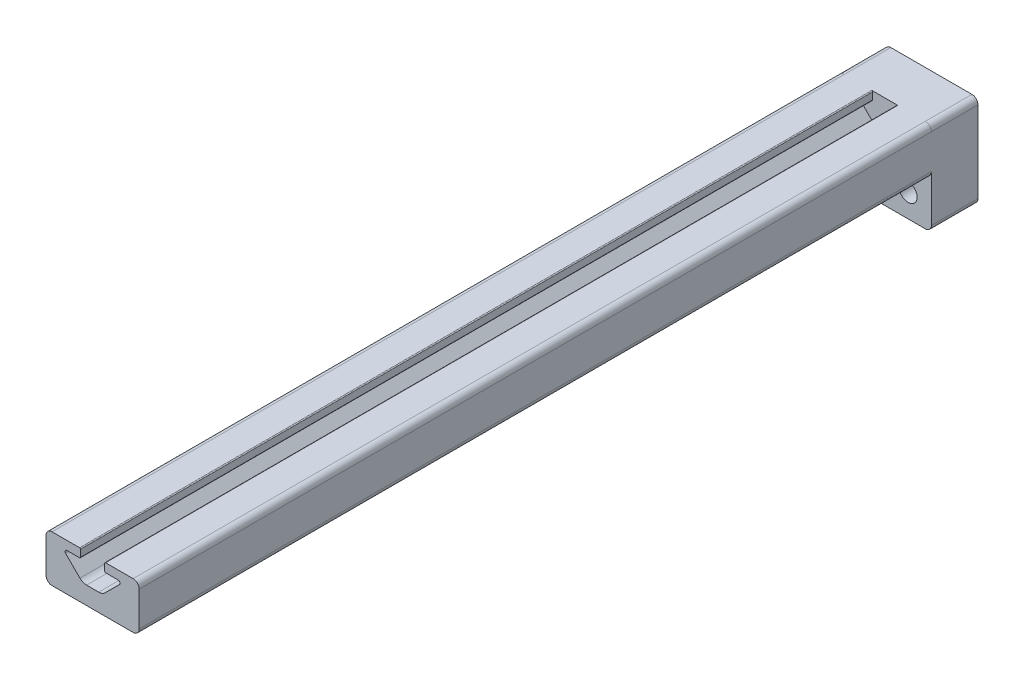
ISO-10303-21;
HEADER;
FILE_DESCRIPTION(('STEP AP214'),'2;1');
FILE_NAME('part.step','',(''),(''),'','','');
FILE_SCHEMA(('AUTOMOTIVE_DESIGN { 1 0 10303 214 1 1 1 1 }'));
ENDSEC;
DATA;
#1=APPLICATION_CONTEXT('core data for automotive mechanical design processes');
#2=APPLICATION_PROTOCOL_DEFINITION('international standard','automotive_design',2000,#1);
#3=PRODUCT_CONTEXT('',#1,'mechanical');
#4=PRODUCT('Part','Part','',(#3));
#5=PRODUCT_RELATED_PRODUCT_CATEGORY('part','',(#4));
#6=PRODUCT_DEFINITION_FORMATION('','',#4);
#7=PRODUCT_DEFINITION_CONTEXT('part definition',#1,'design');
#8=PRODUCT_DEFINITION('design','',#6,#7);
#9=PRODUCT_DEFINITION_SHAPE('','',#8);
#10=(LENGTH_UNIT() NAMED_UNIT(*) SI_UNIT(.MILLI.,.METRE.));
#11=(NAMED_UNIT(*) PLANE_ANGLE_UNIT() SI_UNIT($,.RADIAN.));
#12=(NAMED_UNIT(*) SI_UNIT($,.STERADIAN.) SOLID_ANGLE_UNIT());
#13=UNCERTAINTY_MEASURE_WITH_UNIT(LENGTH_MEASURE(1.E-05),#10,'distance_accuracy_value','');
#14=(GEOMETRIC_REPRESENTATION_CONTEXT(3) GLOBAL_UNCERTAINTY_ASSIGNED_CONTEXT((#13)) GLOBAL_UNIT_ASSIGNED_CONTEXT((#10,
#11,#12)) REPRESENTATION_CONTEXT('',''));
#15=CARTESIAN_POINT('',(0.,0.,0.));
#16=DIRECTION('',(0.,0.,1.));
#17=DIRECTION('',(1.,0.,0.));
#18=AXIS2_PLACEMENT_3D('',#15,#16,#17);
#19=CARTESIAN_POINT('',(-11.049,11.049,215.9));
#20=DIRECTION('',(0.,0.,-1.));
#21=DIRECTION('',(-1.,0.,0.));
#22=AXIS2_PLACEMENT_3D('',#19,#20,#21);
#23=CYLINDRICAL_SURFACE('',#22,1.651);
#24=CARTESIAN_POINT('',(-11.049,11.049,0.));
#25=DIRECTION('',(0.,0.,1.));
#26=DIRECTION('',(1.,0.,0.));
#27=AXIS2_PLACEMENT_3D('',#24,#25,#26);
#28=CIRCLE('',#27,1.651);
#29=CARTESIAN_POINT('',(-11.049,12.7,0.));
#30=VERTEX_POINT('',#29);
#31=CARTESIAN_POINT('',(-12.7,11.049,0.));
#32=VERTEX_POINT('',#31);
#33=EDGE_CURVE('E476',#30,#32,#28,.T.);
#34=ORIENTED_EDGE('',*,*,#33,.T.);
#35=DIRECTION('',(0.,0.,-1.));
#36=VECTOR('',#35,1.);
#37=CARTESIAN_POINT('',(-12.7,11.049,215.9));
#38=LINE('',#37,#36);
#39=CARTESIAN_POINT('',(-12.7,11.049,215.9));
#40=VERTEX_POINT('',#39);
#41=EDGE_CURVE('E288',#40,#32,#38,.T.);
#42=ORIENTED_EDGE('',*,*,#41,.F.);
#43=CARTESIAN_POINT('',(-11.049,11.049,215.9));
#44=DIRECTION('',(0.,0.,1.));
#45=DIRECTION('',(1.,0.,0.));
#46=AXIS2_PLACEMENT_3D('',#43,#44,#45);
#47=CIRCLE('',#46,1.651);
#48=CARTESIAN_POINT('',(-11.049,12.7,215.9));
#49=VERTEX_POINT('',#48);
#50=EDGE_CURVE('E410',#49,#40,#47,.T.);
#51=ORIENTED_EDGE('',*,*,#50,.F.);
#52=DIRECTION('',(0.,0.,-1.));
#53=VECTOR('',#52,1.);
#54=CARTESIAN_POINT('',(-11.049,12.7,215.9));
#55=LINE('',#54,#53);
#56=EDGE_CURVE('E475',#49,#30,#55,.T.);
#57=ORIENTED_EDGE('',*,*,#56,.T.);
#58=EDGE_LOOP('',(#34,#42,#51,#57));
#59=FACE_BOUND('',#58,.T.);
#60=ADVANCED_FACE('F39',(#59),#23,.T.);
#61=CARTESIAN_POINT('',(-12.7,11.049,215.9));
#62=DIRECTION('',(1.,0.,0.));
#63=DIRECTION('',(0.,0.,-1.));
#64=AXIS2_PLACEMENT_3D('',#61,#62,#63);
#65=PLANE('',#64);
#66=DIRECTION('',(0.,1.,0.));
#67=VECTOR('',#66,1.);
#68=CARTESIAN_POINT('',(-12.7,-12.7,-12.7));
#69=LINE('',#68,#67);
#70=CARTESIAN_POINT('',(-12.7,-11.049,-12.7));
#71=VERTEX_POINT('',#70);
#72=CARTESIAN_POINT('',(-12.7,11.049,-12.7));
#73=VERTEX_POINT('',#72);
#74=EDGE_CURVE('E662',#71,#73,#69,.T.);
#75=ORIENTED_EDGE('',*,*,#74,.F.);
#76=DIRECTION('',(0.,0.,1.));
#77=VECTOR('',#76,1.);
#78=CARTESIAN_POINT('',(-12.7,-11.049,215.9));
#79=LINE('',#78,#77);
#80=CARTESIAN_POINT('',(-12.7,-11.049,0.));
#81=VERTEX_POINT('',#80);
#82=EDGE_CURVE('E346',#71,#81,#79,.T.);
#83=ORIENTED_EDGE('',*,*,#82,.T.);
#84=DIRECTION('',(0.,1.,0.));
#85=VECTOR('',#84,1.);
#86=CARTESIAN_POINT('',(-12.7,-12.7,0.));
#87=LINE('',#86,#85);
#88=CARTESIAN_POINT('',(-12.7,1.65099999999999,0.));
#89=VERTEX_POINT('',#88);
#90=EDGE_CURVE('E398',#81,#89,#87,.T.);
#91=ORIENTED_EDGE('',*,*,#90,.T.);
#92=DIRECTION('',(0.,0.,-1.));
#93=VECTOR('',#92,1.);
#94=CARTESIAN_POINT('',(-12.7,1.65099999999999,215.9));
#95=LINE('',#94,#93);
#96=CARTESIAN_POINT('',(-12.7,1.65099999999999,215.9));
#97=VERTEX_POINT('',#96);
#98=EDGE_CURVE('E284',#97,#89,#95,.T.);
#99=ORIENTED_EDGE('',*,*,#98,.F.);
#100=DIRECTION('',(0.,-1.,0.));
#101=VECTOR('',#100,1.);
#102=CARTESIAN_POINT('',(-12.7,11.049,215.9));
#103=LINE('',#102,#101);
#104=EDGE_CURVE('E414',#40,#97,#103,.T.);
#105=ORIENTED_EDGE('',*,*,#104,.F.);
#106=ORIENTED_EDGE('',*,*,#41,.T.);
#107=DIRECTION('',(0.,0.,1.));
#108=VECTOR('',#107,1.);
#109=CARTESIAN_POINT('',(-12.7,11.049,215.9));
#110=LINE('',#109,#108);
#111=EDGE_CURVE('E343',#32,#73,#110,.F.);
#112=ORIENTED_EDGE('',*,*,#111,.T.);
#113=EDGE_LOOP('',(#75,#83,#91,#99,#105,#106,#112));
#114=FACE_BOUND('',#113,.T.);
#115=ADVANCED_FACE('F646',(#114),#65,.F.);
#116=CARTESIAN_POINT('',(-11.049,1.65099999999999,215.9));
#117=DIRECTION('',(0.,0.,-1.));
#118=DIRECTION('',(-1.,0.,0.));
#119=AXIS2_PLACEMENT_3D('',#116,#117,#118);
#120=CYLINDRICAL_SURFACE('',#119,1.651);
#121=CARTESIAN_POINT('',(-11.049,1.65099999999999,0.));
#122=DIRECTION('',(0.,0.,1.));
#123=DIRECTION('',(1.,0.,0.));
#124=AXIS2_PLACEMENT_3D('',#121,#122,#123);
#125=CIRCLE('',#124,1.651);
#126=CARTESIAN_POINT('',(-11.049,0.,0.));
#127=VERTEX_POINT('',#126);
#128=EDGE_CURVE('E480',#89,#127,#125,.T.);
#129=ORIENTED_EDGE('',*,*,#128,.T.);
#130=DIRECTION('',(0.,0.,-1.));
#131=VECTOR('',#130,1.);
#132=CARTESIAN_POINT('',(-11.049,0.,215.9));
#133=LINE('',#132,#131);
#134=CARTESIAN_POINT('',(-11.049,0.,215.9));
#135=VERTEX_POINT('',#134);
#136=EDGE_CURVE('E280',#135,#127,#133,.T.);
#137=ORIENTED_EDGE('',*,*,#136,.F.);
#138=CARTESIAN_POINT('',(-11.049,1.65099999999999,215.9));
#139=DIRECTION('',(0.,0.,1.));
#140=DIRECTION('',(1.,0.,0.));
#141=AXIS2_PLACEMENT_3D('',#138,#139,#140);
#142=CIRCLE('',#141,1.651);
#143=EDGE_CURVE('E418',#97,#135,#142,.T.);
#144=ORIENTED_EDGE('',*,*,#143,.F.);
#145=ORIENTED_EDGE('',*,*,#98,.T.);
#146=EDGE_LOOP('',(#129,#137,#144,#145));
#147=FACE_BOUND('',#146,.T.);
#148=ADVANCED_FACE('F653',(#147),#120,.T.);
#149=CARTESIAN_POINT('',(11.049,0.,215.9));
#150=DIRECTION('',(0.,1.,0.));
#151=DIRECTION('',(-1.,0.,0.));
#152=AXIS2_PLACEMENT_3D('',#149,#150,#151);
#153=PLANE('',#152);
#154=DIRECTION('',(1.,0.,0.));
#155=VECTOR('',#154,1.);
#156=CARTESIAN_POINT('',(11.049,0.,0.));
#157=LINE('',#156,#155);
#158=CARTESIAN_POINT('',(11.049,0.,0.));
#159=VERTEX_POINT('',#158);
#160=EDGE_CURVE('E485',#127,#159,#157,.T.);
#161=ORIENTED_EDGE('',*,*,#160,.T.);
#162=DIRECTION('',(0.,0.,-1.));
#163=VECTOR('',#162,1.);
#164=CARTESIAN_POINT('',(11.049,0.,215.9));
#165=LINE('',#164,#163);
#166=CARTESIAN_POINT('',(11.049,0.,215.9));
#167=VERTEX_POINT('',#166);
#168=EDGE_CURVE('E271',#167,#159,#165,.T.);
#169=ORIENTED_EDGE('',*,*,#168,.F.);
#170=DIRECTION('',(1.,0.,0.));
#171=VECTOR('',#170,1.);
#172=CARTESIAN_POINT('',(11.049,0.,215.9));
#173=LINE('',#172,#171);
#174=EDGE_CURVE('E421',#135,#167,#173,.T.);
#175=ORIENTED_EDGE('',*,*,#174,.F.);
#176=ORIENTED_EDGE('',*,*,#136,.T.);
#177=EDGE_LOOP('',(#161,#169,#175,#176));
#178=FACE_BOUND('',#177,.T.);
#179=ADVANCED_FACE('F656',(#178),#153,.F.);
#180=CARTESIAN_POINT('',(11.049,1.651,215.9));
#181=DIRECTION('',(0.,0.,-1.));
#182=DIRECTION('',(-1.,0.,0.));
#183=AXIS2_PLACEMENT_3D('',#180,#181,#182);
#184=CYLINDRICAL_SURFACE('',#183,1.651);
#185=CARTESIAN_POINT('',(11.049,1.651,0.));
#186=DIRECTION('',(0.,0.,1.));
#187=DIRECTION('',(1.,0.,0.));
#188=AXIS2_PLACEMENT_3D('',#185,#186,#187);
#189=CIRCLE('',#188,1.651);
#190=CARTESIAN_POINT('',(12.7,1.651,0.));
#191=VERTEX_POINT('',#190);
#192=EDGE_CURVE('E246',#159,#191,#189,.T.);
#193=ORIENTED_EDGE('',*,*,#192,.T.);
#194=DIRECTION('',(0.,0.,-1.));
#195=VECTOR('',#194,1.);
#196=CARTESIAN_POINT('',(12.7,1.651,215.9));
#197=LINE('',#196,#195);
#198=CARTESIAN_POINT('',(12.7,1.651,215.9));
#199=VERTEX_POINT('',#198);
#200=EDGE_CURVE('E265',#199,#191,#197,.T.);
#201=ORIENTED_EDGE('',*,*,#200,.F.);
#202=CARTESIAN_POINT('',(11.049,1.651,215.9));
#203=DIRECTION('',(0.,0.,1.));
#204=DIRECTION('',(1.,0.,0.));
#205=AXIS2_PLACEMENT_3D('',#202,#203,#204);
#206=CIRCLE('',#205,1.651);
#207=EDGE_CURVE('E424',#167,#199,#206,.T.);
#208=ORIENTED_EDGE('',*,*,#207,.F.);
#209=ORIENTED_EDGE('',*,*,#168,.T.);
#210=EDGE_LOOP('',(#193,#201,#208,#209));
#211=FACE_BOUND('',#210,.T.);
#212=ADVANCED_FACE('F660',(#211),#184,.T.);
#213=CARTESIAN_POINT('',(12.7,1.651,215.9));
#214=DIRECTION('',(-1.,0.,0.));
#215=DIRECTION('',(0.,0.,1.));
#216=AXIS2_PLACEMENT_3D('',#213,#214,#215);
#217=PLANE('',#216);
#218=DIRECTION('',(0.,-1.,0.));
#219=VECTOR('',#218,1.);
#220=CARTESIAN_POINT('',(12.7,-12.7,0.));
#221=LINE('',#220,#219);
#222=CARTESIAN_POINT('',(12.7,-11.049,0.));
#223=VERTEX_POINT('',#222);
#224=EDGE_CURVE('E376',#191,#223,#221,.T.);
#225=ORIENTED_EDGE('',*,*,#224,.T.);
#226=DIRECTION('',(0.,0.,1.));
#227=VECTOR('',#226,1.);
#228=CARTESIAN_POINT('',(12.7,-11.049,215.9));
#229=LINE('',#228,#227);
#230=CARTESIAN_POINT('',(12.7,-11.049,-12.7));
#231=VERTEX_POINT('',#230);
#232=EDGE_CURVE('E259',#223,#231,#229,.F.);
#233=ORIENTED_EDGE('',*,*,#232,.T.);
#234=DIRECTION('',(0.,-1.,0.));
#235=VECTOR('',#234,1.);
#236=CARTESIAN_POINT('',(12.7,-12.7,-12.7));
#237=LINE('',#236,#235);
#238=CARTESIAN_POINT('',(12.7,11.049,-12.7));
#239=VERTEX_POINT('',#238);
#240=EDGE_CURVE('E257',#239,#231,#237,.T.);
#241=ORIENTED_EDGE('',*,*,#240,.F.);
#242=DIRECTION('',(0.,0.,1.));
#243=VECTOR('',#242,1.);
#244=CARTESIAN_POINT('',(12.7,11.049,215.9));
#245=LINE('',#244,#243);
#246=CARTESIAN_POINT('',(12.7,11.049,0.));
#247=VERTEX_POINT('',#246);
#248=EDGE_CURVE('E240',#239,#247,#245,.T.);
#249=ORIENTED_EDGE('',*,*,#248,.T.);
#250=DIRECTION('',(0.,0.,-1.));
#251=VECTOR('',#250,1.);
#252=CARTESIAN_POINT('',(12.7,11.049,215.9));
#253=LINE('',#252,#251);
#254=CARTESIAN_POINT('',(12.7,11.049,215.9));
#255=VERTEX_POINT('',#254);
#256=EDGE_CURVE('E254',#255,#247,#253,.T.);
#257=ORIENTED_EDGE('',*,*,#256,.F.);
#258=DIRECTION('',(0.,1.,0.));
#259=VECTOR('',#258,1.);
#260=CARTESIAN_POINT('',(12.7,1.651,215.9));
#261=LINE('',#260,#259);
#262=EDGE_CURVE('E427',#199,#255,#261,.T.);
#263=ORIENTED_EDGE('',*,*,#262,.F.);
#264=ORIENTED_EDGE('',*,*,#200,.T.);
#265=EDGE_LOOP('',(#225,#233,#241,#249,#257,#263,#264));
#266=FACE_BOUND('',#265,.T.);
#267=ADVANCED_FACE('F252',(#266),#217,.F.);
#268=CARTESIAN_POINT('',(11.049,11.049,215.9));
#269=DIRECTION('',(0.,0.,-1.));
#270=DIRECTION('',(-1.,0.,0.));
#271=AXIS2_PLACEMENT_3D('',#268,#269,#270);
#272=CYLINDRICAL_SURFACE('',#271,1.651);
#273=CARTESIAN_POINT('',(11.049,11.049,0.));
#274=DIRECTION('',(0.,0.,1.));
#275=DIRECTION('',(1.,0.,0.));
#276=AXIS2_PLACEMENT_3D('',#273,#274,#275);
#277=CIRCLE('',#276,1.651);
#278=CARTESIAN_POINT('',(11.049,12.7,0.));
#279=VERTEX_POINT('',#278);
#280=EDGE_CURVE('E237',#247,#279,#277,.T.);
#281=ORIENTED_EDGE('',*,*,#280,.T.);
#282=DIRECTION('',(0.,0.,-1.));
#283=VECTOR('',#282,1.);
#284=CARTESIAN_POINT('',(11.049,12.7,215.9));
#285=LINE('',#284,#283);
#286=CARTESIAN_POINT('',(11.049,12.7,215.9));
#287=VERTEX_POINT('',#286);
#288=EDGE_CURVE('E266',#287,#279,#285,.T.);
#289=ORIENTED_EDGE('',*,*,#288,.F.);
#290=CARTESIAN_POINT('',(11.049,11.049,215.9));
#291=DIRECTION('',(0.,0.,1.));
#292=DIRECTION('',(1.,0.,0.));
#293=AXIS2_PLACEMENT_3D('',#290,#291,#292);
#294=CIRCLE('',#293,1.651);
#295=EDGE_CURVE('E263',#255,#287,#294,.T.);
#296=ORIENTED_EDGE('',*,*,#295,.F.);
#297=ORIENTED_EDGE('',*,*,#256,.T.);
#298=EDGE_LOOP('',(#281,#289,#296,#297));
#299=FACE_BOUND('',#298,.T.);
#300=ADVANCED_FACE('F262',(#299),#272,.T.);
#301=CARTESIAN_POINT('',(3.302,12.7,215.9));
#302=DIRECTION('',(1.,0.,0.));
#303=DIRECTION('',(0.,1.,0.));
#304=AXIS2_PLACEMENT_3D('',#301,#302,#303);
#305=PLANE('',#304);
#306=DIRECTION('',(0.,-1.,0.));
#307=VECTOR('',#306,1.);
#308=CARTESIAN_POINT('',(3.302,12.7,0.));
#309=LINE('',#308,#307);
#310=CARTESIAN_POINT('',(3.302,12.446,0.));
#311=VERTEX_POINT('',#310);
#312=CARTESIAN_POINT('',(3.302,10.582863886556,0.));
#313=VERTEX_POINT('',#312);
#314=EDGE_CURVE('E245',#311,#313,#309,.T.);
#315=ORIENTED_EDGE('',*,*,#314,.T.);
#316=DIRECTION('',(0.,0.,-1.));
#317=VECTOR('',#316,1.);
#318=CARTESIAN_POINT('',(3.302,10.582863886556,215.9));
#319=LINE('',#318,#317);
#320=CARTESIAN_POINT('',(3.302,10.582863886556,215.9));
#321=VERTEX_POINT('',#320);
#322=EDGE_CURVE('E311',#313,#321,#319,.F.);
#323=ORIENTED_EDGE('',*,*,#322,.T.);
#324=DIRECTION('',(0.,-1.,0.));
#325=VECTOR('',#324,1.);
#326=CARTESIAN_POINT('',(3.302,12.7,215.9));
#327=LINE('',#326,#325);
#328=CARTESIAN_POINT('',(3.302,12.446,215.9));
#329=VERTEX_POINT('',#328);
#330=EDGE_CURVE('E436',#329,#321,#327,.T.);
#331=ORIENTED_EDGE('',*,*,#330,.F.);
#332=DIRECTION('',(0.,0.,-1.));
#333=VECTOR('',#332,1.);
#334=CARTESIAN_POINT('',(3.302,12.446,215.9));
#335=LINE('',#334,#333);
#336=EDGE_CURVE('E307',#329,#311,#335,.T.);
#337=ORIENTED_EDGE('',*,*,#336,.T.);
#338=EDGE_LOOP('',(#315,#323,#331,#337));
#339=FACE_BOUND('',#338,.T.);
#340=ADVANCED_FACE('F584',(#339),#305,.F.);
#341=CARTESIAN_POINT('',(3.302,10.328863886556,215.9));
#342=DIRECTION('',(0.,1.,0.));
#343=DIRECTION('',(0.,0.,1.));
#344=AXIS2_PLACEMENT_3D('',#341,#342,#343);
#345=PLANE('',#344);
#346=DIRECTION('',(1.,0.,0.));
#347=VECTOR('',#346,1.);
#348=CARTESIAN_POINT('',(3.302,10.328863886556,215.9));
#349=LINE('',#348,#347);
#350=CARTESIAN_POINT('',(3.556,10.328863886556,215.9));
#351=VERTEX_POINT('',#350);
#352=CARTESIAN_POINT('',(6.985,10.328863886556,215.9));
#353=VERTEX_POINT('',#352);
#354=EDGE_CURVE('E440',#351,#353,#349,.T.);
#355=ORIENTED_EDGE('',*,*,#354,.F.);
#356=DIRECTION('',(0.,0.,-1.));
#357=VECTOR('',#356,1.);
#358=CARTESIAN_POINT('',(3.556,10.328863886556,215.9));
#359=LINE('',#358,#357);
#360=CARTESIAN_POINT('',(3.556,10.328863886556,0.));
#361=VERTEX_POINT('',#360);
#362=EDGE_CURVE('E291',#351,#361,#359,.T.);
#363=ORIENTED_EDGE('',*,*,#362,.T.);
#364=DIRECTION('',(1.,0.,0.));
#365=VECTOR('',#364,1.);
#366=CARTESIAN_POINT('',(3.302,10.328863886556,0.));
#367=LINE('',#366,#365);
#368=CARTESIAN_POINT('',(6.985,10.328863886556,0.));
#369=VERTEX_POINT('',#368);
#370=EDGE_CURVE('E495',#361,#369,#367,.T.);
#371=ORIENTED_EDGE('',*,*,#370,.T.);
#372=DIRECTION('',(0.,0.,-1.));
#373=VECTOR('',#372,1.);
#374=CARTESIAN_POINT('',(6.985,10.328863886556,215.9));
#375=LINE('',#374,#373);
#376=EDGE_CURVE('E273',#353,#369,#375,.T.);
#377=ORIENTED_EDGE('',*,*,#376,.F.);
#378=EDGE_LOOP('',(#355,#363,#371,#377));
#379=FACE_BOUND('',#378,.T.);
#380=ADVANCED_FACE('F573',(#379),#345,.F.);
#381=CARTESIAN_POINT('',(6.985,9.82086388655604,215.9));
#382=DIRECTION('',(0.,0.,-1.));
#383=DIRECTION('',(-1.,0.,0.));
#384=AXIS2_PLACEMENT_3D('',#381,#382,#383);
#385=CYLINDRICAL_SURFACE('',#384,0.508);
#386=CARTESIAN_POINT('',(6.985,9.82086388655604,0.));
#387=DIRECTION('',(0.,0.,-1.));
#388=DIRECTION('',(1.,0.,0.));
#389=AXIS2_PLACEMENT_3D('',#386,#387,#388);
#390=CIRCLE('',#389,0.508);
#391=CARTESIAN_POINT('',(7.34421024484277,9.46165364171327,0.));
#392=VERTEX_POINT('',#391);
#393=EDGE_CURVE('E499',#369,#392,#390,.T.);
#394=ORIENTED_EDGE('',*,*,#393,.T.);
#395=DIRECTION('',(0.,0.,-1.));
#396=VECTOR('',#395,1.);
#397=CARTESIAN_POINT('',(7.34421024484277,9.46165364171327,215.9));
#398=LINE('',#397,#396);
#399=CARTESIAN_POINT('',(7.34421024484277,9.46165364171327,215.9));
#400=VERTEX_POINT('',#399);
#401=EDGE_CURVE('E561',#400,#392,#398,.T.);
#402=ORIENTED_EDGE('',*,*,#401,.F.);
#403=CARTESIAN_POINT('',(6.985,9.82086388655604,215.9));
#404=DIRECTION('',(0.,0.,-1.));
#405=DIRECTION('',(1.,0.,0.));
#406=AXIS2_PLACEMENT_3D('',#403,#404,#405);
#407=CIRCLE('',#406,0.508);
#408=EDGE_CURVE('E443',#353,#400,#407,.T.);
#409=ORIENTED_EDGE('',*,*,#408,.F.);
#410=ORIENTED_EDGE('',*,*,#376,.T.);
#411=EDGE_LOOP('',(#394,#402,#409,#410));
#412=FACE_BOUND('',#411,.T.);
#413=ADVANCED_FACE('F569',(#412),#385,.F.);
#414=CARTESIAN_POINT('',(7.34421024484277,9.46165364171327,215.9));
#415=DIRECTION('',(0.707106781186549,-0.707106781186546,0.));
#416=DIRECTION('',(0.707106781186546,0.707106781186549,0.));
#417=AXIS2_PLACEMENT_3D('',#414,#415,#416);
#418=PLANE('',#417);
#419=DIRECTION('',(-0.707106781186546,-0.707106781186549,0.));
#420=VECTOR('',#419,1.);
#421=CARTESIAN_POINT('',(7.34421024484277,9.46165364171327,0.));
#422=LINE('',#421,#420);
#423=CARTESIAN_POINT('',(3.45250537891568,5.56994877578617,0.));
#424=VERTEX_POINT('',#423);
#425=EDGE_CURVE('E503',#392,#424,#422,.T.);
#426=ORIENTED_EDGE('',*,*,#425,.T.);
#427=DIRECTION('',(0.,0.,-1.));
#428=VECTOR('',#427,1.);
#429=CARTESIAN_POINT('',(3.45250537891568,5.56994877578617,215.9));
#430=LINE('',#429,#428);
#431=CARTESIAN_POINT('',(3.45250537891568,5.56994877578617,215.9));
#432=VERTEX_POINT('',#431);
#433=EDGE_CURVE('E557',#432,#424,#430,.T.);
#434=ORIENTED_EDGE('',*,*,#433,.F.);
#435=DIRECTION('',(-0.707106781186546,-0.707106781186549,0.));
#436=VECTOR('',#435,1.);
#437=CARTESIAN_POINT('',(7.34421024484277,9.46165364171327,215.9));
#438=LINE('',#437,#436);
#439=EDGE_CURVE('E446',#400,#432,#438,.T.);
#440=ORIENTED_EDGE('',*,*,#439,.F.);
#441=ORIENTED_EDGE('',*,*,#401,.T.);
#442=EDGE_LOOP('',(#426,#434,#440,#441));
#443=FACE_BOUND('',#442,.T.);
#444=ADVANCED_FACE('F637',(#443),#418,.F.);
#445=CARTESIAN_POINT('',(1.65645415470184,7.366,215.9));
#446=DIRECTION('',(0.,0.,-1.));
#447=DIRECTION('',(-1.,0.,0.));
#448=AXIS2_PLACEMENT_3D('',#445,#446,#447);
#449=CYLINDRICAL_SURFACE('',#448,2.54);
#450=CARTESIAN_POINT('',(1.65645415470184,7.366,0.));
#451=DIRECTION('',(0.,0.,-1.));
#452=DIRECTION('',(1.,0.,0.));
#453=AXIS2_PLACEMENT_3D('',#450,#451,#452);
#454=CIRCLE('',#453,2.54);
#455=CARTESIAN_POINT('',(1.65645415470184,4.826,0.));
#456=VERTEX_POINT('',#455);
#457=EDGE_CURVE('E507',#424,#456,#454,.T.);
#458=ORIENTED_EDGE('',*,*,#457,.T.);
#459=DIRECTION('',(0.,0.,-1.));
#460=VECTOR('',#459,1.);
#461=CARTESIAN_POINT('',(1.65645415470184,4.826,215.9));
#462=LINE('',#461,#460);
#463=CARTESIAN_POINT('',(1.65645415470184,4.826,215.9));
#464=VERTEX_POINT('',#463);
#465=EDGE_CURVE('E553',#464,#456,#462,.T.);
#466=ORIENTED_EDGE('',*,*,#465,.F.);
#467=CARTESIAN_POINT('',(1.65645415470184,7.366,215.9));
#468=DIRECTION('',(0.,0.,-1.));
#469=DIRECTION('',(1.,0.,0.));
#470=AXIS2_PLACEMENT_3D('',#467,#468,#469);
#471=CIRCLE('',#470,2.54);
#472=EDGE_CURVE('E449',#432,#464,#471,.T.);
#473=ORIENTED_EDGE('',*,*,#472,.F.);
#474=ORIENTED_EDGE('',*,*,#433,.T.);
#475=EDGE_LOOP('',(#458,#466,#473,#474));
#476=FACE_BOUND('',#475,.T.);
#477=ADVANCED_FACE('F634',(#476),#449,.F.);
#478=CARTESIAN_POINT('',(1.65645415470184,4.826,215.9));
#479=DIRECTION('',(0.,-1.,0.));
#480=DIRECTION('',(1.,0.,0.));
#481=AXIS2_PLACEMENT_3D('',#478,#479,#480);
#482=PLANE('',#481);
#483=DIRECTION('',(-1.,0.,0.));
#484=VECTOR('',#483,1.);
#485=CARTESIAN_POINT('',(1.65645415470184,4.826,0.));
#486=LINE('',#485,#484);
#487=CARTESIAN_POINT('',(-1.65645415470184,4.826,0.));
#488=VERTEX_POINT('',#487);
#489=EDGE_CURVE('E511',#456,#488,#486,.T.);
#490=ORIENTED_EDGE('',*,*,#489,.T.);
#491=DIRECTION('',(0.,0.,-1.));
#492=VECTOR('',#491,1.);
#493=CARTESIAN_POINT('',(-1.65645415470184,4.826,215.9));
#494=LINE('',#493,#492);
#495=CARTESIAN_POINT('',(-1.65645415470184,4.826,215.9));
#496=VERTEX_POINT('',#495);
#497=EDGE_CURVE('E549',#496,#488,#494,.T.);
#498=ORIENTED_EDGE('',*,*,#497,.F.);
#499=DIRECTION('',(-1.,0.,0.));
#500=VECTOR('',#499,1.);
#501=CARTESIAN_POINT('',(1.65645415470184,4.826,215.9));
#502=LINE('',#501,#500);
#503=EDGE_CURVE('E452',#464,#496,#502,.T.);
#504=ORIENTED_EDGE('',*,*,#503,.F.);
#505=ORIENTED_EDGE('',*,*,#465,.T.);
#506=EDGE_LOOP('',(#490,#498,#504,#505));
#507=FACE_BOUND('',#506,.T.);
#508=ADVANCED_FACE('F629',(#507),#482,.F.);
#509=CARTESIAN_POINT('',(-1.65645415470184,7.366,215.9));
#510=DIRECTION('',(0.,0.,-1.));
#511=DIRECTION('',(-1.,0.,0.));
#512=AXIS2_PLACEMENT_3D('',#509,#510,#511);
#513=CYLINDRICAL_SURFACE('',#512,2.54);
#514=CARTESIAN_POINT('',(-1.65645415470184,7.366,0.));
#515=DIRECTION('',(0.,0.,-1.));
#516=DIRECTION('',(1.,0.,0.));
#517=AXIS2_PLACEMENT_3D('',#514,#515,#516);
#518=CIRCLE('',#517,2.54);
#519=CARTESIAN_POINT('',(-3.45250537891568,5.56994877578617,0.));
#520=VERTEX_POINT('',#519);
#521=EDGE_CURVE('E515',#488,#520,#518,.T.);
#522=ORIENTED_EDGE('',*,*,#521,.T.);
#523=DIRECTION('',(0.,0.,-1.));
#524=VECTOR('',#523,1.);
#525=CARTESIAN_POINT('',(-3.45250537891568,5.56994877578617,215.9));
#526=LINE('',#525,#524);
#527=CARTESIAN_POINT('',(-3.45250537891568,5.56994877578617,215.9));
#528=VERTEX_POINT('',#527);
#529=EDGE_CURVE('E545',#528,#520,#526,.T.);
#530=ORIENTED_EDGE('',*,*,#529,.F.);
#531=CARTESIAN_POINT('',(-1.65645415470184,7.366,215.9));
#532=DIRECTION('',(0.,0.,-1.));
#533=DIRECTION('',(1.,0.,0.));
#534=AXIS2_PLACEMENT_3D('',#531,#532,#533);
#535=CIRCLE('',#534,2.54);
#536=EDGE_CURVE('E455',#496,#528,#535,.T.);
#537=ORIENTED_EDGE('',*,*,#536,.F.);
#538=ORIENTED_EDGE('',*,*,#497,.T.);
#539=EDGE_LOOP('',(#522,#530,#537,#538));
#540=FACE_BOUND('',#539,.T.);
#541=ADVANCED_FACE('F626',(#540),#513,.F.);
#542=CARTESIAN_POINT('',(-3.45250537891568,5.56994877578617,215.9));
#543=DIRECTION('',(-0.707106781186549,-0.707106781186546,0.));
#544=DIRECTION('',(0.707106781186546,-0.707106781186549,0.));
#545=AXIS2_PLACEMENT_3D('',#542,#543,#544);
#546=PLANE('',#545);
#547=DIRECTION('',(-0.707106781186546,0.707106781186549,0.));
#548=VECTOR('',#547,1.);
#549=CARTESIAN_POINT('',(-3.45250537891568,5.56994877578617,0.));
#550=LINE('',#549,#548);
#551=CARTESIAN_POINT('',(-7.34421024484277,9.46165364171327,0.));
#552=VERTEX_POINT('',#551);
#553=EDGE_CURVE('E519',#520,#552,#550,.T.);
#554=ORIENTED_EDGE('',*,*,#553,.T.);
#555=DIRECTION('',(0.,0.,-1.));
#556=VECTOR('',#555,1.);
#557=CARTESIAN_POINT('',(-7.34421024484277,9.46165364171327,215.9));
#558=LINE('',#557,#556);
#559=CARTESIAN_POINT('',(-7.34421024484277,9.46165364171327,215.9));
#560=VERTEX_POINT('',#559);
#561=EDGE_CURVE('E541',#560,#552,#558,.T.);
#562=ORIENTED_EDGE('',*,*,#561,.F.);
#563=DIRECTION('',(-0.707106781186546,0.707106781186549,0.));
#564=VECTOR('',#563,1.);
#565=CARTESIAN_POINT('',(-3.45250537891568,5.56994877578617,215.9));
#566=LINE('',#565,#564);
#567=EDGE_CURVE('E458',#528,#560,#566,.T.);
#568=ORIENTED_EDGE('',*,*,#567,.F.);
#569=ORIENTED_EDGE('',*,*,#529,.T.);
#570=EDGE_LOOP('',(#554,#562,#568,#569));
#571=FACE_BOUND('',#570,.T.);
#572=ADVANCED_FACE('F621',(#571),#546,.F.);
#573=CARTESIAN_POINT('',(-6.985,9.82086388655604,215.9));
#574=DIRECTION('',(0.,0.,-1.));
#575=DIRECTION('',(-1.,0.,0.));
#576=AXIS2_PLACEMENT_3D('',#573,#574,#575);
#577=CYLINDRICAL_SURFACE('',#576,0.507999999999999);
#578=CARTESIAN_POINT('',(-6.985,9.82086388655604,0.));
#579=DIRECTION('',(0.,0.,-1.));
#580=DIRECTION('',(1.,0.,0.));
#581=AXIS2_PLACEMENT_3D('',#578,#579,#580);
#582=CIRCLE('',#581,0.507999999999999);
#583=CARTESIAN_POINT('',(-6.985,10.328863886556,0.));
#584=VERTEX_POINT('',#583);
#585=EDGE_CURVE('E523',#552,#584,#582,.T.);
#586=ORIENTED_EDGE('',*,*,#585,.T.);
#587=DIRECTION('',(0.,0.,-1.));
#588=VECTOR('',#587,1.);
#589=CARTESIAN_POINT('',(-6.985,10.328863886556,215.9));
#590=LINE('',#589,#588);
#591=CARTESIAN_POINT('',(-6.985,10.328863886556,215.9));
#592=VERTEX_POINT('',#591);
#593=EDGE_CURVE('E537',#592,#584,#590,.T.);
#594=ORIENTED_EDGE('',*,*,#593,.F.);
#595=CARTESIAN_POINT('',(-6.985,9.82086388655604,215.9));
#596=DIRECTION('',(0.,0.,-1.));
#597=DIRECTION('',(1.,0.,0.));
#598=AXIS2_PLACEMENT_3D('',#595,#596,#597);
#599=CIRCLE('',#598,0.507999999999999);
#600=EDGE_CURVE('E461',#560,#592,#599,.T.);
#601=ORIENTED_EDGE('',*,*,#600,.F.);
#602=ORIENTED_EDGE('',*,*,#561,.T.);
#603=EDGE_LOOP('',(#586,#594,#601,#602));
#604=FACE_BOUND('',#603,.T.);
#605=ADVANCED_FACE('F618',(#604),#577,.F.);
#606=CARTESIAN_POINT('',(-6.985,10.328863886556,215.9));
#607=DIRECTION('',(0.,1.,0.));
#608=DIRECTION('',(-1.,0.,0.));
#609=AXIS2_PLACEMENT_3D('',#606,#607,#608);
#610=PLANE('',#609);
#611=DIRECTION('',(1.,0.,0.));
#612=VECTOR('',#611,1.);
#613=CARTESIAN_POINT('',(-6.985,10.328863886556,0.));
#614=LINE('',#613,#612);
#615=CARTESIAN_POINT('',(-3.556,10.328863886556,0.));
#616=VERTEX_POINT('',#615);
#617=EDGE_CURVE('E527',#584,#616,#614,.T.);
#618=ORIENTED_EDGE('',*,*,#617,.T.);
#619=DIRECTION('',(0.,0.,-1.));
#620=VECTOR('',#619,1.);
#621=CARTESIAN_POINT('',(-3.556,10.328863886556,215.9));
#622=LINE('',#621,#620);
#623=CARTESIAN_POINT('',(-3.556,10.328863886556,215.9));
#624=VERTEX_POINT('',#623);
#625=EDGE_CURVE('E336',#616,#624,#622,.F.);
#626=ORIENTED_EDGE('',*,*,#625,.T.);
#627=DIRECTION('',(1.,0.,0.));
#628=VECTOR('',#627,1.);
#629=CARTESIAN_POINT('',(-6.985,10.328863886556,215.9));
#630=LINE('',#629,#628);
#631=EDGE_CURVE('E464',#592,#624,#630,.T.);
#632=ORIENTED_EDGE('',*,*,#631,.F.);
#633=ORIENTED_EDGE('',*,*,#593,.T.);
#634=EDGE_LOOP('',(#618,#626,#632,#633));
#635=FACE_BOUND('',#634,.T.);
#636=ADVANCED_FACE('F613',(#635),#610,.F.);
#637=CARTESIAN_POINT('',(-3.302,12.7,215.9));
#638=DIRECTION('',(-1.,0.,0.));
#639=DIRECTION('',(0.,-1.,0.));
#640=AXIS2_PLACEMENT_3D('',#637,#638,#639);
#641=PLANE('',#640);
#642=DIRECTION('',(0.,1.,0.));
#643=VECTOR('',#642,1.);
#644=CARTESIAN_POINT('',(-3.302,12.7,215.9));
#645=LINE('',#644,#643);
#646=CARTESIAN_POINT('',(-3.302,10.582863886556,215.9));
#647=VERTEX_POINT('',#646);
#648=CARTESIAN_POINT('',(-3.302,12.446,215.9));
#649=VERTEX_POINT('',#648);
#650=EDGE_CURVE('E468',#647,#649,#645,.T.);
#651=ORIENTED_EDGE('',*,*,#650,.F.);
#652=DIRECTION('',(0.,0.,-1.));
#653=VECTOR('',#652,1.);
#654=CARTESIAN_POINT('',(-3.302,10.582863886556,215.9));
#655=LINE('',#654,#653);
#656=CARTESIAN_POINT('',(-3.302,10.582863886556,0.));
#657=VERTEX_POINT('',#656);
#658=EDGE_CURVE('E332',#647,#657,#655,.T.);
#659=ORIENTED_EDGE('',*,*,#658,.T.);
#660=DIRECTION('',(0.,1.,0.));
#661=VECTOR('',#660,1.);
#662=CARTESIAN_POINT('',(-3.302,12.7,0.));
#663=LINE('',#662,#661);
#664=CARTESIAN_POINT('',(-3.302,12.446,0.));
#665=VERTEX_POINT('',#664);
#666=EDGE_CURVE('E415',#657,#665,#663,.T.);
#667=ORIENTED_EDGE('',*,*,#666,.T.);
#668=DIRECTION('',(0.,0.,-1.));
#669=VECTOR('',#668,1.);
#670=CARTESIAN_POINT('',(-3.302,12.446,215.9));
#671=LINE('',#670,#669);
#672=EDGE_CURVE('E329',#665,#649,#671,.F.);
#673=ORIENTED_EDGE('',*,*,#672,.T.);
#674=EDGE_LOOP('',(#651,#659,#667,#673));
#675=FACE_BOUND('',#674,.T.);
#676=ADVANCED_FACE('F606',(#675),#641,.F.);
#677=CARTESIAN_POINT('',(-11.049,12.7,215.9));
#678=DIRECTION('',(0.,-1.,0.));
#679=DIRECTION('',(1.,0.,0.));
#680=AXIS2_PLACEMENT_3D('',#677,#678,#679);
#681=PLANE('',#680);
#682=DIRECTION('',(1.,0.,0.));
#683=VECTOR('',#682,1.);
#684=CARTESIAN_POINT('',(12.7,12.7,-12.7));
#685=LINE('',#684,#683);
#686=CARTESIAN_POINT('',(-11.049,12.7,-12.7));
#687=VERTEX_POINT('',#686);
#688=CARTESIAN_POINT('',(11.049,12.7,-12.7));
#689=VERTEX_POINT('',#688);
#690=EDGE_CURVE('E481',#687,#689,#685,.T.);
#691=ORIENTED_EDGE('',*,*,#690,.F.);
#692=DIRECTION('',(0.,0.,1.));
#693=VECTOR('',#692,1.);
#694=CARTESIAN_POINT('',(-11.049,12.7,215.9));
#695=LINE('',#694,#693);
#696=EDGE_CURVE('E11',#687,#30,#695,.T.);
#697=ORIENTED_EDGE('',*,*,#696,.T.);
#698=ORIENTED_EDGE('',*,*,#56,.F.);
#699=DIRECTION('',(-1.,0.,0.));
#700=VECTOR('',#699,1.);
#701=CARTESIAN_POINT('',(-11.049,12.7,215.9));
#702=LINE('',#701,#700);
#703=CARTESIAN_POINT('',(-3.556,12.7,215.9));
#704=VERTEX_POINT('',#703);
#705=EDGE_CURVE('E472',#704,#49,#702,.T.);
#706=ORIENTED_EDGE('',*,*,#705,.F.);
#707=DIRECTION('',(0.,0.,-1.));
#708=VECTOR('',#707,1.);
#709=CARTESIAN_POINT('',(-3.556,12.7,215.9));
#710=LINE('',#709,#708);
#711=CARTESIAN_POINT('',(-3.556,12.7,0.));
#712=VERTEX_POINT('',#711);
#713=EDGE_CURVE('E339',#704,#712,#710,.T.);
#714=ORIENTED_EDGE('',*,*,#713,.T.);
#715=DIRECTION('',(1.,0.,0.));
#716=VECTOR('',#715,1.);
#717=CARTESIAN_POINT('',(12.7,12.7,0.));
#718=LINE('',#717,#716);
#719=CARTESIAN_POINT('',(3.556,12.7,0.));
#720=VERTEX_POINT('',#719);
#721=EDGE_CURVE('E384',#712,#720,#718,.T.);
#722=ORIENTED_EDGE('',*,*,#721,.T.);
#723=DIRECTION('',(0.,0.,-1.));
#724=VECTOR('',#723,1.);
#725=CARTESIAN_POINT('',(3.556,12.7,215.9));
#726=LINE('',#725,#724);
#727=CARTESIAN_POINT('',(3.556,12.7,215.9));
#728=VERTEX_POINT('',#727);
#729=EDGE_CURVE('E326',#720,#728,#726,.F.);
#730=ORIENTED_EDGE('',*,*,#729,.T.);
#731=DIRECTION('',(-1.,0.,0.));
#732=VECTOR('',#731,1.);
#733=CARTESIAN_POINT('',(3.302,12.7,215.9));
#734=LINE('',#733,#732);
#735=EDGE_CURVE('E432',#287,#728,#734,.T.);
#736=ORIENTED_EDGE('',*,*,#735,.F.);
#737=ORIENTED_EDGE('',*,*,#288,.T.);
#738=DIRECTION('',(0.,0.,1.));
#739=VECTOR('',#738,1.);
#740=CARTESIAN_POINT('',(11.049,12.7,215.9));
#741=LINE('',#740,#739);
#742=EDGE_CURVE('E48',#279,#689,#741,.F.);
#743=ORIENTED_EDGE('',*,*,#742,.T.);
#744=EDGE_LOOP('',(#691,#697,#698,#706,#714,#722,#730,#736,#737,#743));
#745=FACE_BOUND('',#744,.T.);
#746=ADVANCED_FACE('F595',(#745),#681,.F.);
#747=CARTESIAN_POINT('',(-11.049,11.049,215.9));
#748=DIRECTION('',(0.,0.,1.));
#749=DIRECTION('',(1.,0.,0.));
#750=AXIS2_PLACEMENT_3D('',#747,#748,#749);
#751=PLANE('',#750);
#752=ORIENTED_EDGE('',*,*,#330,.T.);
#753=CARTESIAN_POINT('',(3.556,10.582863886556,215.9));
#754=DIRECTION('',(0.,0.,1.));
#755=DIRECTION('',(1.,0.,0.));
#756=AXIS2_PLACEMENT_3D('',#753,#754,#755);
#757=CIRCLE('',#756,0.254);
#758=EDGE_CURVE('E323',#321,#351,#757,.T.);
#759=ORIENTED_EDGE('',*,*,#758,.T.);
#760=ORIENTED_EDGE('',*,*,#354,.T.);
#761=ORIENTED_EDGE('',*,*,#408,.T.);
#762=ORIENTED_EDGE('',*,*,#439,.T.);
#763=ORIENTED_EDGE('',*,*,#472,.T.);
#764=ORIENTED_EDGE('',*,*,#503,.T.);
#765=ORIENTED_EDGE('',*,*,#536,.T.);
#766=ORIENTED_EDGE('',*,*,#567,.T.);
#767=ORIENTED_EDGE('',*,*,#600,.T.);
#768=ORIENTED_EDGE('',*,*,#631,.T.);
#769=CARTESIAN_POINT('',(-3.556,10.582863886556,215.9));
#770=DIRECTION('',(0.,0.,1.));
#771=DIRECTION('',(1.,0.,0.));
#772=AXIS2_PLACEMENT_3D('',#769,#770,#771);
#773=CIRCLE('',#772,0.254);
#774=EDGE_CURVE('E317',#624,#647,#773,.T.);
#775=ORIENTED_EDGE('',*,*,#774,.T.);
#776=ORIENTED_EDGE('',*,*,#650,.T.);
#777=CARTESIAN_POINT('',(-3.556,12.446,215.9));
#778=DIRECTION('',(0.,0.,1.));
#779=DIRECTION('',(1.,0.,0.));
#780=AXIS2_PLACEMENT_3D('',#777,#778,#779);
#781=CIRCLE('',#780,0.254);
#782=EDGE_CURVE('E314',#649,#704,#781,.T.);
#783=ORIENTED_EDGE('',*,*,#782,.T.);
#784=ORIENTED_EDGE('',*,*,#705,.T.);
#785=ORIENTED_EDGE('',*,*,#50,.T.);
#786=ORIENTED_EDGE('',*,*,#104,.T.);
#787=ORIENTED_EDGE('',*,*,#143,.T.);
#788=ORIENTED_EDGE('',*,*,#174,.T.);
#789=ORIENTED_EDGE('',*,*,#207,.T.);
#790=ORIENTED_EDGE('',*,*,#262,.T.);
#791=ORIENTED_EDGE('',*,*,#295,.T.);
#792=ORIENTED_EDGE('',*,*,#735,.T.);
#793=CARTESIAN_POINT('',(3.556,12.446,215.9));
#794=DIRECTION('',(0.,0.,1.));
#795=DIRECTION('',(1.,0.,0.));
#796=AXIS2_PLACEMENT_3D('',#793,#794,#795);
#797=CIRCLE('',#796,0.254);
#798=EDGE_CURVE('E320',#728,#329,#797,.T.);
#799=ORIENTED_EDGE('',*,*,#798,.T.);
#800=EDGE_LOOP('',(#752,#759,#760,#761,#762,#763,#764,#765,#766,#767,#768,#775,#776,#783,#784,
#785,#786,#787,#788,#789,#790,#791,#792,#799));
#801=FACE_BOUND('',#800,.T.);
#802=ADVANCED_FACE('F587',(#801),#751,.T.);
#803=CARTESIAN_POINT('',(3.556,10.582863886556,215.9));
#804=DIRECTION('',(0.,0.,-1.));
#805=DIRECTION('',(-1.,0.,0.));
#806=AXIS2_PLACEMENT_3D('',#803,#804,#805);
#807=CYLINDRICAL_SURFACE('',#806,0.254);
#808=ORIENTED_EDGE('',*,*,#758,.F.);
#809=ORIENTED_EDGE('',*,*,#322,.F.);
#810=CARTESIAN_POINT('',(3.556,10.582863886556,0.));
#811=DIRECTION('',(0.,0.,1.));
#812=DIRECTION('',(1.,0.,0.));
#813=AXIS2_PLACEMENT_3D('',#810,#811,#812);
#814=CIRCLE('',#813,0.254);
#815=EDGE_CURVE('E304',#361,#313,#814,.F.);
#816=ORIENTED_EDGE('',*,*,#815,.F.);
#817=ORIENTED_EDGE('',*,*,#362,.F.);
#818=EDGE_LOOP('',(#808,#809,#816,#817));
#819=FACE_BOUND('',#818,.T.);
#820=ADVANCED_FACE('F581',(#819),#807,.T.);
#821=CARTESIAN_POINT('',(3.556,12.446,215.9));
#822=DIRECTION('',(0.,0.,-1.));
#823=DIRECTION('',(-1.,0.,0.));
#824=AXIS2_PLACEMENT_3D('',#821,#822,#823);
#825=CYLINDRICAL_SURFACE('',#824,0.254);
#826=ORIENTED_EDGE('',*,*,#798,.F.);
#827=ORIENTED_EDGE('',*,*,#729,.F.);
#828=CARTESIAN_POINT('',(3.556,12.446,0.));
#829=DIRECTION('',(0.,0.,1.));
#830=DIRECTION('',(1.,0.,0.));
#831=AXIS2_PLACEMENT_3D('',#828,#829,#830);
#832=CIRCLE('',#831,0.254);
#833=EDGE_CURVE('E301',#311,#720,#832,.F.);
#834=ORIENTED_EDGE('',*,*,#833,.F.);
#835=ORIENTED_EDGE('',*,*,#336,.F.);
#836=EDGE_LOOP('',(#826,#827,#834,#835));
#837=FACE_BOUND('',#836,.T.);
#838=ADVANCED_FACE('F592',(#837),#825,.T.);
#839=CARTESIAN_POINT('',(-3.556,10.582863886556,215.9));
#840=DIRECTION('',(0.,0.,-1.));
#841=DIRECTION('',(-1.,0.,0.));
#842=AXIS2_PLACEMENT_3D('',#839,#840,#841);
#843=CYLINDRICAL_SURFACE('',#842,0.254);
#844=ORIENTED_EDGE('',*,*,#774,.F.);
#845=ORIENTED_EDGE('',*,*,#625,.F.);
#846=CARTESIAN_POINT('',(-3.556,10.582863886556,0.));
#847=DIRECTION('',(0.,0.,1.));
#848=DIRECTION('',(1.,0.,0.));
#849=AXIS2_PLACEMENT_3D('',#846,#847,#848);
#850=CIRCLE('',#849,0.254);
#851=EDGE_CURVE('E298',#657,#616,#850,.F.);
#852=ORIENTED_EDGE('',*,*,#851,.F.);
#853=ORIENTED_EDGE('',*,*,#658,.F.);
#854=EDGE_LOOP('',(#844,#845,#852,#853));
#855=FACE_BOUND('',#854,.T.);
#856=ADVANCED_FACE('F610',(#855),#843,.T.);
#857=CARTESIAN_POINT('',(-3.556,12.446,215.9));
#858=DIRECTION('',(0.,0.,-1.));
#859=DIRECTION('',(-1.,0.,0.));
#860=AXIS2_PLACEMENT_3D('',#857,#858,#859);
#861=CYLINDRICAL_SURFACE('',#860,0.254);
#862=ORIENTED_EDGE('',*,*,#782,.F.);
#863=ORIENTED_EDGE('',*,*,#672,.F.);
#864=CARTESIAN_POINT('',(-3.556,12.446,0.));
#865=DIRECTION('',(0.,0.,1.));
#866=DIRECTION('',(1.,0.,0.));
#867=AXIS2_PLACEMENT_3D('',#864,#865,#866);
#868=CIRCLE('',#867,0.254);
#869=EDGE_CURVE('E295',#712,#665,#868,.F.);
#870=ORIENTED_EDGE('',*,*,#869,.F.);
#871=ORIENTED_EDGE('',*,*,#713,.F.);
#872=EDGE_LOOP('',(#862,#863,#870,#871));
#873=FACE_BOUND('',#872,.T.);
#874=ADVANCED_FACE('F601',(#873),#861,.T.);
#875=CARTESIAN_POINT('',(0.,0.,0.));
#876=DIRECTION('',(0.,0.,1.));
#877=DIRECTION('',(1.,0.,0.));
#878=AXIS2_PLACEMENT_3D('',#875,#876,#877);
#879=PLANE('',#878);
#880=CARTESIAN_POINT('',(6.35,-6.35,0.));
#881=DIRECTION('',(0.,0.,1.));
#882=DIRECTION('',(1.,0.,0.));
#883=AXIS2_PLACEMENT_3D('',#880,#881,#882);
#884=CIRCLE('',#883,2.45745);
#885=CARTESIAN_POINT('',(8.80744999999999,-6.35,0.));
#886=VERTEX_POINT('',#885);
#887=EDGE_CURVE('E716',#886,#886,#884,.T.);
#888=ORIENTED_EDGE('',*,*,#887,.F.);
#889=EDGE_LOOP('',(#888));
#890=FACE_BOUND('',#889,.T.);
#891=CARTESIAN_POINT('',(-6.35,-6.35,0.));
#892=DIRECTION('',(0.,0.,1.));
#893=DIRECTION('',(1.,0.,0.));
#894=AXIS2_PLACEMENT_3D('',#891,#892,#893);
#895=CIRCLE('',#894,2.45745);
#896=CARTESIAN_POINT('',(-3.89255,-6.35,0.));
#897=VERTEX_POINT('',#896);
#898=EDGE_CURVE('E403',#897,#897,#895,.T.);
#899=ORIENTED_EDGE('',*,*,#898,.F.);
#900=EDGE_LOOP('',(#899));
#901=FACE_BOUND('',#900,.T.);
#902=ORIENTED_EDGE('',*,*,#90,.F.);
#903=CARTESIAN_POINT('',(-11.049,-11.049,0.));
#904=DIRECTION('',(0.,0.,1.));
#905=DIRECTION('',(1.,0.,0.));
#906=AXIS2_PLACEMENT_3D('',#903,#904,#905);
#907=CIRCLE('',#906,1.651);
#908=CARTESIAN_POINT('',(-11.049,-12.7,0.));
#909=VERTEX_POINT('',#908);
#910=EDGE_CURVE('E353',#81,#909,#907,.T.);
#911=ORIENTED_EDGE('',*,*,#910,.T.);
#912=DIRECTION('',(-1.,0.,0.));
#913=VECTOR('',#912,1.);
#914=CARTESIAN_POINT('',(12.7,-12.7,0.));
#915=LINE('',#914,#913);
#916=CARTESIAN_POINT('',(11.049,-12.7,0.));
#917=VERTEX_POINT('',#916);
#918=EDGE_CURVE('E392',#917,#909,#915,.T.);
#919=ORIENTED_EDGE('',*,*,#918,.F.);
#920=CARTESIAN_POINT('',(11.049,-11.049,0.));
#921=DIRECTION('',(0.,0.,1.));
#922=DIRECTION('',(1.,0.,0.));
#923=AXIS2_PLACEMENT_3D('',#920,#921,#922);
#924=CIRCLE('',#923,1.651);
#925=EDGE_CURVE('E350',#917,#223,#924,.T.);
#926=ORIENTED_EDGE('',*,*,#925,.T.);
#927=ORIENTED_EDGE('',*,*,#224,.F.);
#928=ORIENTED_EDGE('',*,*,#192,.F.);
#929=ORIENTED_EDGE('',*,*,#160,.F.);
#930=ORIENTED_EDGE('',*,*,#128,.F.);
#931=EDGE_LOOP('',(#902,#911,#919,#926,#927,#928,#929,#930));
#932=FACE_BOUND('',#931,.T.);
#933=ADVANCED_FACE('F396',(#890,#901,#932),#879,.T.);
#934=CARTESIAN_POINT('',(12.7,-12.7,-12.7));
#935=DIRECTION('',(0.,1.,0.));
#936=DIRECTION('',(0.,0.,1.));
#937=AXIS2_PLACEMENT_3D('',#934,#935,#936);
#938=PLANE('',#937);
#939=ORIENTED_EDGE('',*,*,#918,.T.);
#940=DIRECTION('',(0.,0.,1.));
#941=VECTOR('',#940,1.);
#942=CARTESIAN_POINT('',(-11.049,-12.7,-12.7));
#943=LINE('',#942,#941);
#944=CARTESIAN_POINT('',(-11.049,-12.7,-12.7));
#945=VERTEX_POINT('',#944);
#946=EDGE_CURVE('E360',#909,#945,#943,.F.);
#947=ORIENTED_EDGE('',*,*,#946,.T.);
#948=DIRECTION('',(-1.,0.,0.));
#949=VECTOR('',#948,1.);
#950=CARTESIAN_POINT('',(12.7,-12.7,-12.7));
#951=LINE('',#950,#949);
#952=CARTESIAN_POINT('',(11.049,-12.7,-12.7));
#953=VERTEX_POINT('',#952);
#954=EDGE_CURVE('E383',#953,#945,#951,.T.);
#955=ORIENTED_EDGE('',*,*,#954,.F.);
#956=DIRECTION('',(0.,0.,1.));
#957=VECTOR('',#956,1.);
#958=CARTESIAN_POINT('',(11.049,-12.7,-12.7));
#959=LINE('',#958,#957);
#960=EDGE_CURVE('E356',#953,#917,#959,.T.);
#961=ORIENTED_EDGE('',*,*,#960,.T.);
#962=EDGE_LOOP('',(#939,#947,#955,#961));
#963=FACE_BOUND('',#962,.T.);
#964=ADVANCED_FACE('F391',(#963),#938,.F.);
#965=CARTESIAN_POINT('',(0.,0.,-12.7));
#966=DIRECTION('',(0.,0.,1.));
#967=DIRECTION('',(1.,0.,0.));
#968=AXIS2_PLACEMENT_3D('',#965,#966,#967);
#969=PLANE('',#968);
#970=CARTESIAN_POINT('',(6.35,-6.35,-12.7));
#971=DIRECTION('',(0.,0.,-1.));
#972=DIRECTION('',(-1.,0.,0.));
#973=AXIS2_PLACEMENT_3D('',#970,#971,#972);
#974=CIRCLE('',#973,2.45745);
#975=CARTESIAN_POINT('',(3.89255,-6.35,-12.7));
#976=VERTEX_POINT('',#975);
#977=EDGE_CURVE('E728',#976,#976,#974,.T.);
#978=ORIENTED_EDGE('',*,*,#977,.F.);
#979=EDGE_LOOP('',(#978));
#980=FACE_BOUND('',#979,.T.);
#981=CARTESIAN_POINT('',(-6.35,-6.35,-12.7));
#982=DIRECTION('',(0.,0.,-1.));
#983=DIRECTION('',(-1.,0.,0.));
#984=AXIS2_PLACEMENT_3D('',#981,#982,#983);
#985=CIRCLE('',#984,2.45745);
#986=CARTESIAN_POINT('',(-8.80745,-6.35,-12.7));
#987=VERTEX_POINT('',#986);
#988=EDGE_CURVE('E721',#987,#987,#985,.T.);
#989=ORIENTED_EDGE('',*,*,#988,.F.);
#990=EDGE_LOOP('',(#989));
#991=FACE_BOUND('',#990,.T.);
#992=ORIENTED_EDGE('',*,*,#954,.T.);
#993=CARTESIAN_POINT('',(-11.049,-11.049,-12.7));
#994=DIRECTION('',(0.,0.,1.));
#995=DIRECTION('',(1.,0.,0.));
#996=AXIS2_PLACEMENT_3D('',#993,#994,#995);
#997=CIRCLE('',#996,1.651);
#998=EDGE_CURVE('E260',#945,#71,#997,.F.);
#999=ORIENTED_EDGE('',*,*,#998,.T.);
#1000=ORIENTED_EDGE('',*,*,#74,.T.);
#1001=CARTESIAN_POINT('',(-11.049,11.049,-12.7));
#1002=DIRECTION('',(0.,0.,1.));
#1003=DIRECTION('',(1.,0.,0.));
#1004=AXIS2_PLACEMENT_3D('',#1001,#1002,#1003);
#1005=CIRCLE('',#1004,1.651);
#1006=EDGE_CURVE('E61',#73,#687,#1005,.F.);
#1007=ORIENTED_EDGE('',*,*,#1006,.T.);
#1008=ORIENTED_EDGE('',*,*,#690,.T.);
#1009=CARTESIAN_POINT('',(11.049,11.049,-12.7));
#1010=DIRECTION('',(0.,0.,1.));
#1011=DIRECTION('',(1.,0.,0.));
#1012=AXIS2_PLACEMENT_3D('',#1009,#1010,#1011);
#1013=CIRCLE('',#1012,1.651);
#1014=EDGE_CURVE('E363',#689,#239,#1013,.F.);
#1015=ORIENTED_EDGE('',*,*,#1014,.T.);
#1016=ORIENTED_EDGE('',*,*,#240,.T.);
#1017=CARTESIAN_POINT('',(11.049,-11.049,-12.7));
#1018=DIRECTION('',(0.,0.,1.));
#1019=DIRECTION('',(1.,0.,0.));
#1020=AXIS2_PLACEMENT_3D('',#1017,#1018,#1019);
#1021=CIRCLE('',#1020,1.651);
#1022=EDGE_CURVE('E368',#231,#953,#1021,.F.);
#1023=ORIENTED_EDGE('',*,*,#1022,.T.);
#1024=EDGE_LOOP('',(#992,#999,#1000,#1007,#1008,#1015,#1016,#1023));
#1025=FACE_BOUND('',#1024,.T.);
#1026=ADVANCED_FACE('F380',(#980,#991,#1025),#969,.F.);
#1027=ORIENTED_EDGE('',*,*,#314,.F.);
#1028=ORIENTED_EDGE('',*,*,#833,.T.);
#1029=ORIENTED_EDGE('',*,*,#721,.F.);
#1030=ORIENTED_EDGE('',*,*,#869,.T.);
#1031=ORIENTED_EDGE('',*,*,#666,.F.);
#1032=ORIENTED_EDGE('',*,*,#851,.T.);
#1033=ORIENTED_EDGE('',*,*,#617,.F.);
#1034=ORIENTED_EDGE('',*,*,#585,.F.);
#1035=ORIENTED_EDGE('',*,*,#553,.F.);
#1036=ORIENTED_EDGE('',*,*,#521,.F.);
#1037=ORIENTED_EDGE('',*,*,#489,.F.);
#1038=ORIENTED_EDGE('',*,*,#457,.F.);
#1039=ORIENTED_EDGE('',*,*,#425,.F.);
#1040=ORIENTED_EDGE('',*,*,#393,.F.);
#1041=ORIENTED_EDGE('',*,*,#370,.F.);
#1042=ORIENTED_EDGE('',*,*,#815,.T.);
#1043=EDGE_LOOP('',(#1027,#1028,#1029,#1030,#1031,#1032,#1033,#1034,#1035,#1036,#1037,#1038,
#1039,#1040,#1041,#1042));
#1044=FACE_BOUND('',#1043,.T.);
#1045=ADVANCED_FACE('F577',(#1044),#879,.T.);
#1046=CARTESIAN_POINT('',(-11.049,-11.049,215.9));
#1047=DIRECTION('',(0.,0.,1.));
#1048=DIRECTION('',(1.,0.,0.));
#1049=AXIS2_PLACEMENT_3D('',#1046,#1047,#1048);
#1050=CYLINDRICAL_SURFACE('',#1049,1.651);
#1051=ORIENTED_EDGE('',*,*,#998,.F.);
#1052=ORIENTED_EDGE('',*,*,#946,.F.);
#1053=ORIENTED_EDGE('',*,*,#910,.F.);
#1054=ORIENTED_EDGE('',*,*,#82,.F.);
#1055=EDGE_LOOP('',(#1051,#1052,#1053,#1054));
#1056=FACE_BOUND('',#1055,.T.);
#1057=ADVANCED_FACE('F665',(#1056),#1050,.T.);
#1058=CARTESIAN_POINT('',(11.049,-11.049,-12.7));
#1059=DIRECTION('',(0.,0.,1.));
#1060=DIRECTION('',(1.,0.,0.));
#1061=AXIS2_PLACEMENT_3D('',#1058,#1059,#1060);
#1062=CYLINDRICAL_SURFACE('',#1061,1.651);
#1063=ORIENTED_EDGE('',*,*,#1022,.F.);
#1064=ORIENTED_EDGE('',*,*,#232,.F.);
#1065=ORIENTED_EDGE('',*,*,#925,.F.);
#1066=ORIENTED_EDGE('',*,*,#960,.F.);
#1067=EDGE_LOOP('',(#1063,#1064,#1065,#1066));
#1068=FACE_BOUND('',#1067,.T.);
#1069=ADVANCED_FACE('F387',(#1068),#1062,.T.);
#1070=CARTESIAN_POINT('',(-11.049,11.049,215.9));
#1071=DIRECTION('',(0.,0.,1.));
#1072=DIRECTION('',(1.,0.,0.));
#1073=AXIS2_PLACEMENT_3D('',#1070,#1071,#1072);
#1074=CYLINDRICAL_SURFACE('',#1073,1.651);
#1075=ORIENTED_EDGE('',*,*,#1006,.F.);
#1076=ORIENTED_EDGE('',*,*,#111,.F.);
#1077=ORIENTED_EDGE('',*,*,#33,.F.);
#1078=ORIENTED_EDGE('',*,*,#696,.F.);
#1079=EDGE_LOOP('',(#1075,#1076,#1077,#1078));
#1080=FACE_BOUND('',#1079,.T.);
#1081=ADVANCED_FACE('F673',(#1080),#1074,.T.);
#1082=CARTESIAN_POINT('',(11.049,11.049,215.9));
#1083=DIRECTION('',(0.,0.,1.));
#1084=DIRECTION('',(1.,0.,0.));
#1085=AXIS2_PLACEMENT_3D('',#1082,#1083,#1084);
#1086=CYLINDRICAL_SURFACE('',#1085,1.651);
#1087=ORIENTED_EDGE('',*,*,#1014,.F.);
#1088=ORIENTED_EDGE('',*,*,#742,.F.);
#1089=ORIENTED_EDGE('',*,*,#280,.F.);
#1090=ORIENTED_EDGE('',*,*,#248,.F.);
#1091=EDGE_LOOP('',(#1087,#1088,#1089,#1090));
#1092=FACE_BOUND('',#1091,.T.);
#1093=ADVANCED_FACE('F41',(#1092),#1086,.T.);
#1094=CARTESIAN_POINT('',(-6.35,-6.35,-12.7));
#1095=DIRECTION('',(0.,0.,-1.));
#1096=DIRECTION('',(-1.,0.,0.));
#1097=AXIS2_PLACEMENT_3D('',#1094,#1095,#1096);
#1098=CYLINDRICAL_SURFACE('',#1097,2.45745);
#1099=ORIENTED_EDGE('',*,*,#898,.T.);
#1100=EDGE_LOOP('',(#1099));
#1101=FACE_BOUND('',#1100,.T.);
#1102=ORIENTED_EDGE('',*,*,#988,.T.);
#1103=EDGE_LOOP('',(#1102));
#1104=FACE_BOUND('',#1103,.T.);
#1105=ADVANCED_FACE('F679',(#1101,#1104),#1098,.F.);
#1106=CARTESIAN_POINT('',(6.35,-6.35,-12.7));
#1107=DIRECTION('',(0.,0.,-1.));
#1108=DIRECTION('',(-1.,0.,0.));
#1109=AXIS2_PLACEMENT_3D('',#1106,#1107,#1108);
#1110=CYLINDRICAL_SURFACE('',#1109,2.45745);
#1111=ORIENTED_EDGE('',*,*,#887,.T.);
#1112=EDGE_LOOP('',(#1111));
#1113=FACE_BOUND('',#1112,.T.);
#1114=ORIENTED_EDGE('',*,*,#977,.T.);
#1115=EDGE_LOOP('',(#1114));
#1116=FACE_BOUND('',#1115,.T.);
#1117=ADVANCED_FACE('F733',(#1113,#1116),#1110,.F.);
#1118=CLOSED_SHELL('',(#60,#115,#148,#179,#212,#267,#300,#340,#380,#413,#444,#477,#508,#541,
#572,#605,#636,#676,#746,#802,#820,#838,#856,#874,#933,#964,#1026,#1045,#1057,#1069,#1081,#1093,
#1105,#1117));
#1119=MANIFOLD_SOLID_BREP('B2',#1118);
#1120=ADVANCED_BREP_SHAPE_REPRESENTATION('',(#18,#1119),#14);
#1121=SHAPE_DEFINITION_REPRESENTATION(#9,#1120);
ENDSEC;
END-ISO-10303-21;
